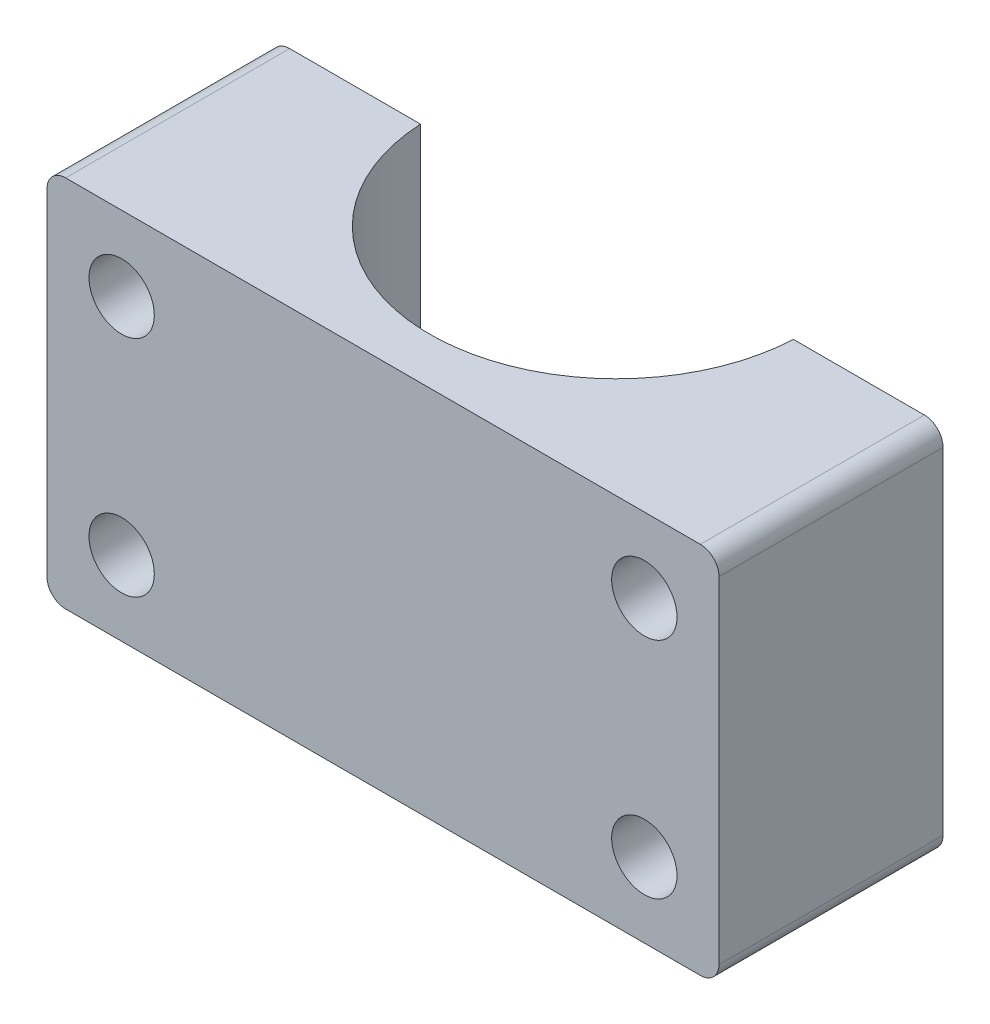
ISO-10303-21;
HEADER;
FILE_DESCRIPTION(('STEP AP214'),'2;1');
FILE_NAME('part.step','',(''),(''),'','','');
FILE_SCHEMA(('AUTOMOTIVE_DESIGN { 1 0 10303 214 1 1 1 1 }'));
ENDSEC;
DATA;
#1=APPLICATION_CONTEXT('core data for automotive mechanical design processes');
#2=APPLICATION_PROTOCOL_DEFINITION('international standard','automotive_design',2000,#1);
#3=PRODUCT_CONTEXT('',#1,'mechanical');
#4=PRODUCT('Part','Part','',(#3));
#5=PRODUCT_RELATED_PRODUCT_CATEGORY('part','',(#4));
#6=PRODUCT_DEFINITION_FORMATION('','',#4);
#7=PRODUCT_DEFINITION_CONTEXT('part definition',#1,'design');
#8=PRODUCT_DEFINITION('design','',#6,#7);
#9=PRODUCT_DEFINITION_SHAPE('','',#8);
#10=(LENGTH_UNIT() NAMED_UNIT(*) SI_UNIT(.MILLI.,.METRE.));
#11=(NAMED_UNIT(*) PLANE_ANGLE_UNIT() SI_UNIT($,.RADIAN.));
#12=(NAMED_UNIT(*) SI_UNIT($,.STERADIAN.) SOLID_ANGLE_UNIT());
#13=UNCERTAINTY_MEASURE_WITH_UNIT(LENGTH_MEASURE(1.E-05),#10,'distance_accuracy_value','');
#14=(GEOMETRIC_REPRESENTATION_CONTEXT(3) GLOBAL_UNCERTAINTY_ASSIGNED_CONTEXT((#13)) GLOBAL_UNIT_ASSIGNED_CONTEXT((#10,
#11,#12)) REPRESENTATION_CONTEXT('',''));
#15=CARTESIAN_POINT('',(0.,0.,0.));
#16=DIRECTION('',(0.,0.,1.));
#17=DIRECTION('',(1.,0.,0.));
#18=AXIS2_PLACEMENT_3D('',#15,#16,#17);
#19=CARTESIAN_POINT('',(-18.,20.,12.));
#20=DIRECTION('',(0.,0.,-1.));
#21=DIRECTION('',(-1.,0.,0.));
#22=AXIS2_PLACEMENT_3D('',#19,#20,#21);
#23=PLANE('',#22);
#24=CARTESIAN_POINT('',(14.,16.,12.));
#25=DIRECTION('',(0.,0.,1.));
#26=DIRECTION('',(1.,0.,0.));
#27=AXIS2_PLACEMENT_3D('',#24,#25,#26);
#28=CIRCLE('',#27,1.75);
#29=CARTESIAN_POINT('',(15.75,16.,12.));
#30=VERTEX_POINT('',#29);
#31=EDGE_CURVE('E214',#30,#30,#28,.T.);
#32=ORIENTED_EDGE('',*,*,#31,.F.);
#33=EDGE_LOOP('',(#32));
#34=FACE_BOUND('',#33,.T.);
#35=CARTESIAN_POINT('',(14.,4.,12.));
#36=DIRECTION('',(0.,0.,1.));
#37=DIRECTION('',(1.,0.,0.));
#38=AXIS2_PLACEMENT_3D('',#35,#36,#37);
#39=CIRCLE('',#38,1.75);
#40=CARTESIAN_POINT('',(15.75,4.,12.));
#41=VERTEX_POINT('',#40);
#42=EDGE_CURVE('E220',#41,#41,#39,.T.);
#43=ORIENTED_EDGE('',*,*,#42,.F.);
#44=EDGE_LOOP('',(#43));
#45=FACE_BOUND('',#44,.T.);
#46=CARTESIAN_POINT('',(-14.,4.,12.));
#47=DIRECTION('',(0.,0.,1.));
#48=DIRECTION('',(1.,0.,0.));
#49=AXIS2_PLACEMENT_3D('',#46,#47,#48);
#50=CIRCLE('',#49,1.75);
#51=CARTESIAN_POINT('',(-12.25,4.,12.));
#52=VERTEX_POINT('',#51);
#53=EDGE_CURVE('E226',#52,#52,#50,.T.);
#54=ORIENTED_EDGE('',*,*,#53,.F.);
#55=EDGE_LOOP('',(#54));
#56=FACE_BOUND('',#55,.T.);
#57=CARTESIAN_POINT('',(-14.,16.,12.));
#58=DIRECTION('',(0.,0.,1.));
#59=DIRECTION('',(1.,0.,0.));
#60=AXIS2_PLACEMENT_3D('',#57,#58,#59);
#61=CIRCLE('',#60,1.75);
#62=CARTESIAN_POINT('',(-12.25,16.,12.));
#63=VERTEX_POINT('',#62);
#64=EDGE_CURVE('E208',#63,#63,#61,.T.);
#65=ORIENTED_EDGE('',*,*,#64,.F.);
#66=EDGE_LOOP('',(#65));
#67=FACE_BOUND('',#66,.T.);
#68=DIRECTION('',(0.,-1.,0.));
#69=VECTOR('',#68,1.);
#70=CARTESIAN_POINT('',(-18.,20.,12.));
#71=LINE('',#70,#69);
#72=CARTESIAN_POINT('',(-18.,19.,12.));
#73=VERTEX_POINT('',#72);
#74=CARTESIAN_POINT('',(-18.,1.,12.));
#75=VERTEX_POINT('',#74);
#76=EDGE_CURVE('E143',#73,#75,#71,.T.);
#77=ORIENTED_EDGE('',*,*,#76,.T.);
#78=CARTESIAN_POINT('',(-17.,1.,12.));
#79=DIRECTION('',(0.,0.,-1.));
#80=DIRECTION('',(-1.,0.,0.));
#81=AXIS2_PLACEMENT_3D('',#78,#79,#80);
#82=CIRCLE('',#81,1.);
#83=CARTESIAN_POINT('',(-17.,0.,12.));
#84=VERTEX_POINT('',#83);
#85=EDGE_CURVE('E178',#75,#84,#82,.F.);
#86=ORIENTED_EDGE('',*,*,#85,.T.);
#87=DIRECTION('',(1.,0.,0.));
#88=VECTOR('',#87,1.);
#89=CARTESIAN_POINT('',(-18.,0.,12.));
#90=LINE('',#89,#88);
#91=CARTESIAN_POINT('',(17.,0.,12.));
#92=VERTEX_POINT('',#91);
#93=EDGE_CURVE('E147',#84,#92,#90,.T.);
#94=ORIENTED_EDGE('',*,*,#93,.T.);
#95=CARTESIAN_POINT('',(17.,1.,12.));
#96=DIRECTION('',(0.,0.,-1.));
#97=DIRECTION('',(-1.,0.,0.));
#98=AXIS2_PLACEMENT_3D('',#95,#96,#97);
#99=CIRCLE('',#98,1.);
#100=CARTESIAN_POINT('',(18.,1.,12.));
#101=VERTEX_POINT('',#100);
#102=EDGE_CURVE('E176',#92,#101,#99,.F.);
#103=ORIENTED_EDGE('',*,*,#102,.T.);
#104=DIRECTION('',(0.,-1.,0.));
#105=VECTOR('',#104,1.);
#106=CARTESIAN_POINT('',(18.,20.,12.));
#107=LINE('',#106,#105);
#108=CARTESIAN_POINT('',(18.,19.,12.));
#109=VERTEX_POINT('',#108);
#110=EDGE_CURVE('E164',#109,#101,#107,.T.);
#111=ORIENTED_EDGE('',*,*,#110,.F.);
#112=CARTESIAN_POINT('',(17.,19.,12.));
#113=DIRECTION('',(0.,0.,-1.));
#114=DIRECTION('',(-1.,0.,0.));
#115=AXIS2_PLACEMENT_3D('',#112,#113,#114);
#116=CIRCLE('',#115,1.);
#117=CARTESIAN_POINT('',(17.,20.,12.));
#118=VERTEX_POINT('',#117);
#119=EDGE_CURVE('E172',#109,#118,#116,.F.);
#120=ORIENTED_EDGE('',*,*,#119,.T.);
#121=DIRECTION('',(1.,0.,0.));
#122=VECTOR('',#121,1.);
#123=CARTESIAN_POINT('',(-18.,20.,12.));
#124=LINE('',#123,#122);
#125=CARTESIAN_POINT('',(-17.,20.,12.));
#126=VERTEX_POINT('',#125);
#127=EDGE_CURVE('E125',#126,#118,#124,.T.);
#128=ORIENTED_EDGE('',*,*,#127,.F.);
#129=CARTESIAN_POINT('',(-17.,19.,12.));
#130=DIRECTION('',(0.,0.,-1.));
#131=DIRECTION('',(-1.,0.,0.));
#132=AXIS2_PLACEMENT_3D('',#129,#130,#131);
#133=CIRCLE('',#132,1.);
#134=EDGE_CURVE('E174',#126,#73,#133,.F.);
#135=ORIENTED_EDGE('',*,*,#134,.T.);
#136=EDGE_LOOP('',(#77,#86,#94,#103,#111,#120,#128,#135));
#137=FACE_BOUND('',#136,.T.);
#138=ADVANCED_FACE('F38',(#34,#45,#56,#67,#137),#23,.F.);
#139=CARTESIAN_POINT('',(18.,20.,12.));
#140=DIRECTION('',(-1.,0.,0.));
#141=DIRECTION('',(0.,0.,1.));
#142=AXIS2_PLACEMENT_3D('',#139,#140,#141);
#143=PLANE('',#142);
#144=ORIENTED_EDGE('',*,*,#110,.T.);
#145=DIRECTION('',(0.,0.,-1.));
#146=VECTOR('',#145,1.);
#147=CARTESIAN_POINT('',(18.,1.,12.));
#148=LINE('',#147,#146);
#149=CARTESIAN_POINT('',(18.,1.,0.));
#150=VERTEX_POINT('',#149);
#151=EDGE_CURVE('E190',#101,#150,#148,.T.);
#152=ORIENTED_EDGE('',*,*,#151,.T.);
#153=DIRECTION('',(0.,-1.,0.));
#154=VECTOR('',#153,1.);
#155=CARTESIAN_POINT('',(18.,20.,0.));
#156=LINE('',#155,#154);
#157=CARTESIAN_POINT('',(18.,19.,0.));
#158=VERTEX_POINT('',#157);
#159=EDGE_CURVE('E135',#158,#150,#156,.T.);
#160=ORIENTED_EDGE('',*,*,#159,.F.);
#161=DIRECTION('',(0.,0.,-1.));
#162=VECTOR('',#161,1.);
#163=CARTESIAN_POINT('',(18.,19.,12.));
#164=LINE('',#163,#162);
#165=EDGE_CURVE('E188',#158,#109,#164,.F.);
#166=ORIENTED_EDGE('',*,*,#165,.T.);
#167=EDGE_LOOP('',(#144,#152,#160,#166));
#168=FACE_BOUND('',#167,.T.);
#169=ADVANCED_FACE('F204',(#168),#143,.F.);
#170=CARTESIAN_POINT('',(9.98749217771909,20.,0.));
#171=DIRECTION('',(0.,0.,1.));
#172=DIRECTION('',(1.,0.,0.));
#173=AXIS2_PLACEMENT_3D('',#170,#171,#172);
#174=PLANE('',#173);
#175=CARTESIAN_POINT('',(14.,16.,0.));
#176=DIRECTION('',(0.,0.,1.));
#177=DIRECTION('',(1.,0.,0.));
#178=AXIS2_PLACEMENT_3D('',#175,#176,#177);
#179=CIRCLE('',#178,1.75);
#180=CARTESIAN_POINT('',(15.75,16.,0.));
#181=VERTEX_POINT('',#180);
#182=EDGE_CURVE('E217',#181,#181,#179,.T.);
#183=ORIENTED_EDGE('',*,*,#182,.T.);
#184=EDGE_LOOP('',(#183));
#185=FACE_BOUND('',#184,.T.);
#186=CARTESIAN_POINT('',(14.,4.,0.));
#187=DIRECTION('',(0.,0.,1.));
#188=DIRECTION('',(1.,0.,0.));
#189=AXIS2_PLACEMENT_3D('',#186,#187,#188);
#190=CIRCLE('',#189,1.75);
#191=CARTESIAN_POINT('',(15.75,4.,0.));
#192=VERTEX_POINT('',#191);
#193=EDGE_CURVE('E223',#192,#192,#190,.T.);
#194=ORIENTED_EDGE('',*,*,#193,.T.);
#195=EDGE_LOOP('',(#194));
#196=FACE_BOUND('',#195,.T.);
#197=ORIENTED_EDGE('',*,*,#159,.T.);
#198=CARTESIAN_POINT('',(17.,1.,0.));
#199=DIRECTION('',(0.,0.,1.));
#200=DIRECTION('',(1.,0.,0.));
#201=AXIS2_PLACEMENT_3D('',#198,#199,#200);
#202=CIRCLE('',#201,1.);
#203=CARTESIAN_POINT('',(17.,0.,0.));
#204=VERTEX_POINT('',#203);
#205=EDGE_CURVE('E61',#150,#204,#202,.F.);
#206=ORIENTED_EDGE('',*,*,#205,.T.);
#207=DIRECTION('',(-1.,0.,0.));
#208=VECTOR('',#207,1.);
#209=CARTESIAN_POINT('',(9.98749217771909,0.,0.));
#210=LINE('',#209,#208);
#211=CARTESIAN_POINT('',(9.98749217771909,0.,0.));
#212=VERTEX_POINT('',#211);
#213=EDGE_CURVE('E132',#204,#212,#210,.T.);
#214=ORIENTED_EDGE('',*,*,#213,.T.);
#215=DIRECTION('',(0.,-1.,0.));
#216=VECTOR('',#215,1.);
#217=CARTESIAN_POINT('',(9.98749217771909,20.,0.));
#218=LINE('',#217,#216);
#219=CARTESIAN_POINT('',(9.98749217771909,20.,0.));
#220=VERTEX_POINT('',#219);
#221=EDGE_CURVE('E128',#220,#212,#218,.T.);
#222=ORIENTED_EDGE('',*,*,#221,.F.);
#223=DIRECTION('',(-1.,0.,0.));
#224=VECTOR('',#223,1.);
#225=CARTESIAN_POINT('',(9.98749217771909,20.,0.));
#226=LINE('',#225,#224);
#227=CARTESIAN_POINT('',(17.,20.,0.));
#228=VERTEX_POINT('',#227);
#229=EDGE_CURVE('E116',#228,#220,#226,.T.);
#230=ORIENTED_EDGE('',*,*,#229,.F.);
#231=CARTESIAN_POINT('',(17.,19.,0.));
#232=DIRECTION('',(0.,0.,1.));
#233=DIRECTION('',(1.,0.,0.));
#234=AXIS2_PLACEMENT_3D('',#231,#232,#233);
#235=CIRCLE('',#234,1.);
#236=EDGE_CURVE('E53',#228,#158,#235,.F.);
#237=ORIENTED_EDGE('',*,*,#236,.T.);
#238=EDGE_LOOP('',(#197,#206,#214,#222,#230,#237));
#239=FACE_BOUND('',#238,.T.);
#240=ADVANCED_FACE('F130',(#185,#196,#239),#174,.F.);
#241=CARTESIAN_POINT('',(0.,20.,-0.5));
#242=DIRECTION('',(0.,-1.,0.));
#243=DIRECTION('',(0.,0.,-1.));
#244=AXIS2_PLACEMENT_3D('',#241,#242,#243);
#245=CYLINDRICAL_SURFACE('',#244,10.);
#246=CARTESIAN_POINT('',(0.,0.,-0.5));
#247=DIRECTION('',(0.,-1.,0.));
#248=DIRECTION('',(0.,0.,1.));
#249=AXIS2_PLACEMENT_3D('',#246,#247,#248);
#250=CIRCLE('',#249,10.);
#251=CARTESIAN_POINT('',(-9.98749217771909,0.,0.));
#252=VERTEX_POINT('',#251);
#253=EDGE_CURVE('E152',#212,#252,#250,.T.);
#254=ORIENTED_EDGE('',*,*,#253,.T.);
#255=DIRECTION('',(0.,-1.,0.));
#256=VECTOR('',#255,1.);
#257=CARTESIAN_POINT('',(-9.98749217771909,20.,0.));
#258=LINE('',#257,#256);
#259=CARTESIAN_POINT('',(-9.98749217771909,20.,0.));
#260=VERTEX_POINT('',#259);
#261=EDGE_CURVE('E136',#260,#252,#258,.T.);
#262=ORIENTED_EDGE('',*,*,#261,.F.);
#263=CARTESIAN_POINT('',(0.,20.,-0.5));
#264=DIRECTION('',(0.,-1.,0.));
#265=DIRECTION('',(0.,0.,1.));
#266=AXIS2_PLACEMENT_3D('',#263,#264,#265);
#267=CIRCLE('',#266,10.);
#268=EDGE_CURVE('E121',#220,#260,#267,.T.);
#269=ORIENTED_EDGE('',*,*,#268,.F.);
#270=ORIENTED_EDGE('',*,*,#221,.T.);
#271=EDGE_LOOP('',(#254,#262,#269,#270));
#272=FACE_BOUND('',#271,.T.);
#273=ADVANCED_FACE('F138',(#272),#245,.F.);
#274=CARTESIAN_POINT('',(-9.98749217771909,20.,0.));
#275=DIRECTION('',(0.,0.,1.));
#276=DIRECTION('',(1.,0.,0.));
#277=AXIS2_PLACEMENT_3D('',#274,#275,#276);
#278=PLANE('',#277);
#279=CARTESIAN_POINT('',(-14.,4.,0.));
#280=DIRECTION('',(0.,0.,1.));
#281=DIRECTION('',(1.,0.,0.));
#282=AXIS2_PLACEMENT_3D('',#279,#280,#281);
#283=CIRCLE('',#282,1.75);
#284=CARTESIAN_POINT('',(-12.25,4.,0.));
#285=VERTEX_POINT('',#284);
#286=EDGE_CURVE('E211',#285,#285,#283,.T.);
#287=ORIENTED_EDGE('',*,*,#286,.T.);
#288=EDGE_LOOP('',(#287));
#289=FACE_BOUND('',#288,.T.);
#290=CARTESIAN_POINT('',(-14.,16.,0.));
#291=DIRECTION('',(0.,0.,1.));
#292=DIRECTION('',(1.,0.,0.));
#293=AXIS2_PLACEMENT_3D('',#290,#291,#292);
#294=CIRCLE('',#293,1.75);
#295=CARTESIAN_POINT('',(-12.25,16.,0.));
#296=VERTEX_POINT('',#295);
#297=EDGE_CURVE('E150',#296,#296,#294,.T.);
#298=ORIENTED_EDGE('',*,*,#297,.T.);
#299=EDGE_LOOP('',(#298));
#300=FACE_BOUND('',#299,.T.);
#301=DIRECTION('',(-1.,0.,0.));
#302=VECTOR('',#301,1.);
#303=CARTESIAN_POINT('',(-9.98749217771909,0.,0.));
#304=LINE('',#303,#302);
#305=CARTESIAN_POINT('',(-17.,0.,0.));
#306=VERTEX_POINT('',#305);
#307=EDGE_CURVE('E154',#252,#306,#304,.T.);
#308=ORIENTED_EDGE('',*,*,#307,.T.);
#309=CARTESIAN_POINT('',(-17.,1.,0.));
#310=DIRECTION('',(0.,0.,1.));
#311=DIRECTION('',(1.,0.,0.));
#312=AXIS2_PLACEMENT_3D('',#309,#310,#311);
#313=CIRCLE('',#312,1.);
#314=CARTESIAN_POINT('',(-18.,1.,0.));
#315=VERTEX_POINT('',#314);
#316=EDGE_CURVE('E186',#306,#315,#313,.F.);
#317=ORIENTED_EDGE('',*,*,#316,.T.);
#318=DIRECTION('',(0.,-1.,0.));
#319=VECTOR('',#318,1.);
#320=CARTESIAN_POINT('',(-18.,20.,0.));
#321=LINE('',#320,#319);
#322=CARTESIAN_POINT('',(-18.,19.,0.));
#323=VERTEX_POINT('',#322);
#324=EDGE_CURVE('E159',#323,#315,#321,.T.);
#325=ORIENTED_EDGE('',*,*,#324,.F.);
#326=CARTESIAN_POINT('',(-17.,19.,0.));
#327=DIRECTION('',(0.,0.,1.));
#328=DIRECTION('',(1.,0.,0.));
#329=AXIS2_PLACEMENT_3D('',#326,#327,#328);
#330=CIRCLE('',#329,1.);
#331=CARTESIAN_POINT('',(-17.,20.,0.));
#332=VERTEX_POINT('',#331);
#333=EDGE_CURVE('E184',#323,#332,#330,.F.);
#334=ORIENTED_EDGE('',*,*,#333,.T.);
#335=DIRECTION('',(-1.,0.,0.));
#336=VECTOR('',#335,1.);
#337=CARTESIAN_POINT('',(-9.98749217771909,20.,0.));
#338=LINE('',#337,#336);
#339=EDGE_CURVE('E141',#260,#332,#338,.T.);
#340=ORIENTED_EDGE('',*,*,#339,.F.);
#341=ORIENTED_EDGE('',*,*,#261,.T.);
#342=EDGE_LOOP('',(#308,#317,#325,#334,#340,#341));
#343=FACE_BOUND('',#342,.T.);
#344=ADVANCED_FACE('F232',(#289,#300,#343),#278,.F.);
#345=CARTESIAN_POINT('',(-18.,20.,0.));
#346=DIRECTION('',(1.,0.,0.));
#347=DIRECTION('',(0.,0.,-1.));
#348=AXIS2_PLACEMENT_3D('',#345,#346,#347);
#349=PLANE('',#348);
#350=ORIENTED_EDGE('',*,*,#324,.T.);
#351=DIRECTION('',(0.,0.,1.));
#352=VECTOR('',#351,1.);
#353=CARTESIAN_POINT('',(-18.,1.,0.));
#354=LINE('',#353,#352);
#355=EDGE_CURVE('E169',#315,#75,#354,.T.);
#356=ORIENTED_EDGE('',*,*,#355,.T.);
#357=ORIENTED_EDGE('',*,*,#76,.F.);
#358=DIRECTION('',(0.,0.,1.));
#359=VECTOR('',#358,1.);
#360=CARTESIAN_POINT('',(-18.,19.,0.));
#361=LINE('',#360,#359);
#362=EDGE_CURVE('E167',#73,#323,#361,.F.);
#363=ORIENTED_EDGE('',*,*,#362,.T.);
#364=EDGE_LOOP('',(#350,#356,#357,#363));
#365=FACE_BOUND('',#364,.T.);
#366=ADVANCED_FACE('F262',(#365),#349,.F.);
#367=CARTESIAN_POINT('',(0.,20.,-0.5));
#368=DIRECTION('',(0.,1.,0.));
#369=DIRECTION('',(0.,0.,1.));
#370=AXIS2_PLACEMENT_3D('',#367,#368,#369);
#371=PLANE('',#370);
#372=ORIENTED_EDGE('',*,*,#339,.T.);
#373=DIRECTION('',(0.,0.,1.));
#374=VECTOR('',#373,1.);
#375=CARTESIAN_POINT('',(-17.,20.,12.));
#376=LINE('',#375,#374);
#377=EDGE_CURVE('E11',#332,#126,#376,.T.);
#378=ORIENTED_EDGE('',*,*,#377,.T.);
#379=ORIENTED_EDGE('',*,*,#127,.T.);
#380=DIRECTION('',(0.,0.,-1.));
#381=VECTOR('',#380,1.);
#382=CARTESIAN_POINT('',(17.,20.,0.));
#383=LINE('',#382,#381);
#384=EDGE_CURVE('E46',#118,#228,#383,.T.);
#385=ORIENTED_EDGE('',*,*,#384,.T.);
#386=ORIENTED_EDGE('',*,*,#229,.T.);
#387=ORIENTED_EDGE('',*,*,#268,.T.);
#388=EDGE_LOOP('',(#372,#378,#379,#385,#386,#387));
#389=FACE_BOUND('',#388,.T.);
#390=ADVANCED_FACE('F119',(#389),#371,.T.);
#391=CARTESIAN_POINT('',(0.,0.,-0.5));
#392=DIRECTION('',(0.,1.,0.));
#393=DIRECTION('',(0.,0.,1.));
#394=AXIS2_PLACEMENT_3D('',#391,#392,#393);
#395=PLANE('',#394);
#396=ORIENTED_EDGE('',*,*,#93,.F.);
#397=DIRECTION('',(0.,0.,1.));
#398=VECTOR('',#397,1.);
#399=CARTESIAN_POINT('',(-17.,0.,-0.500000000000005));
#400=LINE('',#399,#398);
#401=EDGE_CURVE('E182',#84,#306,#400,.F.);
#402=ORIENTED_EDGE('',*,*,#401,.T.);
#403=ORIENTED_EDGE('',*,*,#307,.F.);
#404=ORIENTED_EDGE('',*,*,#253,.F.);
#405=ORIENTED_EDGE('',*,*,#213,.F.);
#406=DIRECTION('',(0.,0.,-1.));
#407=VECTOR('',#406,1.);
#408=CARTESIAN_POINT('',(17.,0.,-0.499999999999985));
#409=LINE('',#408,#407);
#410=EDGE_CURVE('E180',#204,#92,#409,.F.);
#411=ORIENTED_EDGE('',*,*,#410,.T.);
#412=EDGE_LOOP('',(#396,#402,#403,#404,#405,#411));
#413=FACE_BOUND('',#412,.T.);
#414=ADVANCED_FACE('F196',(#413),#395,.F.);
#415=CARTESIAN_POINT('',(-14.,16.,0.));
#416=DIRECTION('',(0.,0.,1.));
#417=DIRECTION('',(1.,0.,0.));
#418=AXIS2_PLACEMENT_3D('',#415,#416,#417);
#419=CYLINDRICAL_SURFACE('',#418,1.75);
#420=ORIENTED_EDGE('',*,*,#297,.F.);
#421=EDGE_LOOP('',(#420));
#422=FACE_BOUND('',#421,.T.);
#423=ORIENTED_EDGE('',*,*,#64,.T.);
#424=EDGE_LOOP('',(#423));
#425=FACE_BOUND('',#424,.T.);
#426=ADVANCED_FACE('F239',(#422,#425),#419,.F.);
#427=CARTESIAN_POINT('',(-14.,4.,0.));
#428=DIRECTION('',(0.,0.,1.));
#429=DIRECTION('',(1.,0.,0.));
#430=AXIS2_PLACEMENT_3D('',#427,#428,#429);
#431=CYLINDRICAL_SURFACE('',#430,1.75);
#432=ORIENTED_EDGE('',*,*,#286,.F.);
#433=EDGE_LOOP('',(#432));
#434=FACE_BOUND('',#433,.T.);
#435=ORIENTED_EDGE('',*,*,#53,.T.);
#436=EDGE_LOOP('',(#435));
#437=FACE_BOUND('',#436,.T.);
#438=ADVANCED_FACE('F235',(#434,#437),#431,.F.);
#439=CARTESIAN_POINT('',(14.,4.,0.));
#440=DIRECTION('',(0.,0.,1.));
#441=DIRECTION('',(1.,0.,0.));
#442=AXIS2_PLACEMENT_3D('',#439,#440,#441);
#443=CYLINDRICAL_SURFACE('',#442,1.75);
#444=ORIENTED_EDGE('',*,*,#193,.F.);
#445=EDGE_LOOP('',(#444));
#446=FACE_BOUND('',#445,.T.);
#447=ORIENTED_EDGE('',*,*,#42,.T.);
#448=EDGE_LOOP('',(#447));
#449=FACE_BOUND('',#448,.T.);
#450=ADVANCED_FACE('F238',(#446,#449),#443,.F.);
#451=CARTESIAN_POINT('',(14.,16.,0.));
#452=DIRECTION('',(0.,0.,1.));
#453=DIRECTION('',(1.,0.,0.));
#454=AXIS2_PLACEMENT_3D('',#451,#452,#453);
#455=CYLINDRICAL_SURFACE('',#454,1.75);
#456=ORIENTED_EDGE('',*,*,#182,.F.);
#457=EDGE_LOOP('',(#456));
#458=FACE_BOUND('',#457,.T.);
#459=ORIENTED_EDGE('',*,*,#31,.T.);
#460=EDGE_LOOP('',(#459));
#461=FACE_BOUND('',#460,.T.);
#462=ADVANCED_FACE('F259',(#458,#461),#455,.F.);
#463=CARTESIAN_POINT('',(-17.,1.,0.));
#464=DIRECTION('',(0.,0.,1.));
#465=DIRECTION('',(1.,0.,0.));
#466=AXIS2_PLACEMENT_3D('',#463,#464,#465);
#467=CYLINDRICAL_SURFACE('',#466,1.);
#468=ORIENTED_EDGE('',*,*,#316,.F.);
#469=ORIENTED_EDGE('',*,*,#401,.F.);
#470=ORIENTED_EDGE('',*,*,#85,.F.);
#471=ORIENTED_EDGE('',*,*,#355,.F.);
#472=EDGE_LOOP('',(#468,#469,#470,#471));
#473=FACE_BOUND('',#472,.T.);
#474=ADVANCED_FACE('F276',(#473),#467,.T.);
#475=CARTESIAN_POINT('',(17.,1.,12.));
#476=DIRECTION('',(0.,0.,-1.));
#477=DIRECTION('',(-1.,0.,0.));
#478=AXIS2_PLACEMENT_3D('',#475,#476,#477);
#479=CYLINDRICAL_SURFACE('',#478,1.);
#480=ORIENTED_EDGE('',*,*,#102,.F.);
#481=ORIENTED_EDGE('',*,*,#410,.F.);
#482=ORIENTED_EDGE('',*,*,#205,.F.);
#483=ORIENTED_EDGE('',*,*,#151,.F.);
#484=EDGE_LOOP('',(#480,#481,#482,#483));
#485=FACE_BOUND('',#484,.T.);
#486=ADVANCED_FACE('F199',(#485),#479,.T.);
#487=CARTESIAN_POINT('',(-17.,19.,-0.500000000000005));
#488=DIRECTION('',(0.,0.,-1.));
#489=DIRECTION('',(-1.,0.,0.));
#490=AXIS2_PLACEMENT_3D('',#487,#488,#489);
#491=CYLINDRICAL_SURFACE('',#490,1.);
#492=ORIENTED_EDGE('',*,*,#333,.F.);
#493=ORIENTED_EDGE('',*,*,#362,.F.);
#494=ORIENTED_EDGE('',*,*,#134,.F.);
#495=ORIENTED_EDGE('',*,*,#377,.F.);
#496=EDGE_LOOP('',(#492,#493,#494,#495));
#497=FACE_BOUND('',#496,.T.);
#498=ADVANCED_FACE('F281',(#497),#491,.T.);
#499=CARTESIAN_POINT('',(17.,19.,-0.499999999999985));
#500=DIRECTION('',(0.,0.,1.));
#501=DIRECTION('',(1.,0.,0.));
#502=AXIS2_PLACEMENT_3D('',#499,#500,#501);
#503=CYLINDRICAL_SURFACE('',#502,1.);
#504=ORIENTED_EDGE('',*,*,#119,.F.);
#505=ORIENTED_EDGE('',*,*,#165,.F.);
#506=ORIENTED_EDGE('',*,*,#236,.F.);
#507=ORIENTED_EDGE('',*,*,#384,.F.);
#508=EDGE_LOOP('',(#504,#505,#506,#507));
#509=FACE_BOUND('',#508,.T.);
#510=ADVANCED_FACE('F40',(#509),#503,.T.);
#511=CLOSED_SHELL('',(#138,#169,#240,#273,#344,#366,#390,#414,#426,#438,#450,#462,#474,#486,
#498,#510));
#512=MANIFOLD_SOLID_BREP('B2',#511);
#513=ADVANCED_BREP_SHAPE_REPRESENTATION('',(#18,#512),#14);
#514=SHAPE_DEFINITION_REPRESENTATION(#9,#513);
ENDSEC;
END-ISO-10303-21;
